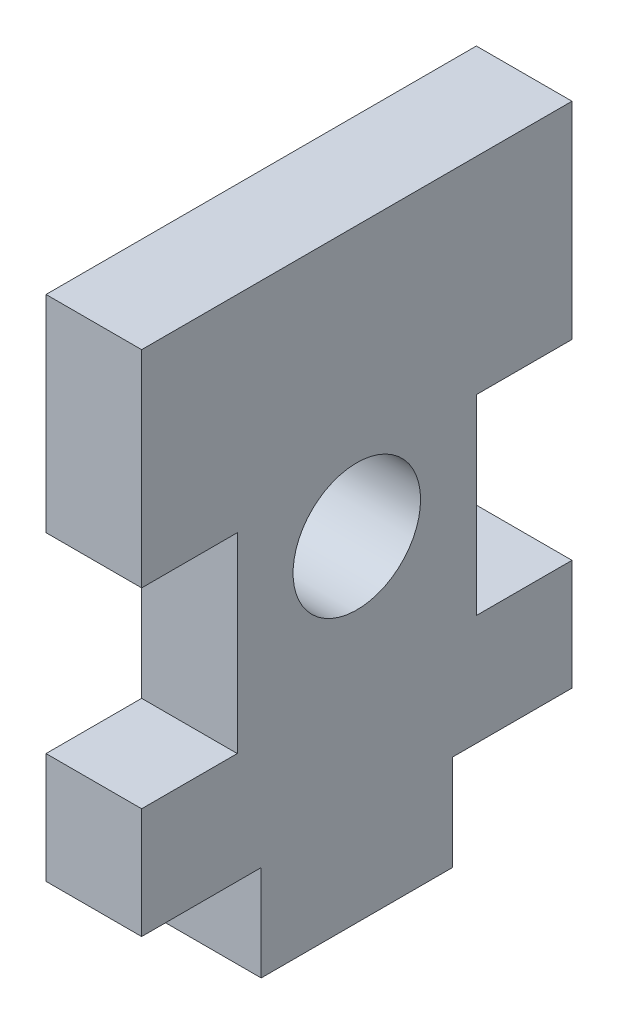
ISO-10303-21;
HEADER;
FILE_DESCRIPTION(('STEP AP214'),'2;1');
FILE_NAME('part.step','',(''),(''),'','','');
FILE_SCHEMA(('AUTOMOTIVE_DESIGN { 1 0 10303 214 1 1 1 1 }'));
ENDSEC;
DATA;
#1=APPLICATION_CONTEXT('core data for automotive mechanical design processes');
#2=APPLICATION_PROTOCOL_DEFINITION('international standard','automotive_design',2000,#1);
#3=PRODUCT_CONTEXT('',#1,'mechanical');
#4=PRODUCT('Part','Part','',(#3));
#5=PRODUCT_RELATED_PRODUCT_CATEGORY('part','',(#4));
#6=PRODUCT_DEFINITION_FORMATION('','',#4);
#7=PRODUCT_DEFINITION_CONTEXT('part definition',#1,'design');
#8=PRODUCT_DEFINITION('design','',#6,#7);
#9=PRODUCT_DEFINITION_SHAPE('','',#8);
#10=(LENGTH_UNIT() NAMED_UNIT(*) SI_UNIT(.MILLI.,.METRE.));
#11=(NAMED_UNIT(*) PLANE_ANGLE_UNIT() SI_UNIT($,.RADIAN.));
#12=(NAMED_UNIT(*) SI_UNIT($,.STERADIAN.) SOLID_ANGLE_UNIT());
#13=UNCERTAINTY_MEASURE_WITH_UNIT(LENGTH_MEASURE(1.E-05),#10,'distance_accuracy_value','');
#14=(GEOMETRIC_REPRESENTATION_CONTEXT(3) GLOBAL_UNCERTAINTY_ASSIGNED_CONTEXT((#13)) GLOBAL_UNIT_ASSIGNED_CONTEXT((#10,
#11,#12)) REPRESENTATION_CONTEXT('',''));
#15=CARTESIAN_POINT('',(0.,0.,0.));
#16=DIRECTION('',(0.,0.,1.));
#17=DIRECTION('',(1.,0.,0.));
#18=AXIS2_PLACEMENT_3D('',#15,#16,#17);
#19=CARTESIAN_POINT('',(6.,0.,0.));
#20=DIRECTION('',(1.,0.,0.));
#21=DIRECTION('',(0.,0.,-1.));
#22=AXIS2_PLACEMENT_3D('',#19,#20,#21);
#23=PLANE('',#22);
#24=DIRECTION('',(0.,0.,-1.));
#25=VECTOR('',#24,1.);
#26=CARTESIAN_POINT('',(6.,18.9458591085876,13.5));
#27=LINE('',#26,#25);
#28=CARTESIAN_POINT('',(6.,18.9458591085876,13.5));
#29=VERTEX_POINT('',#28);
#30=CARTESIAN_POINT('',(6.,18.9458591085876,7.5));
#31=VERTEX_POINT('',#30);
#32=EDGE_CURVE('E168',#29,#31,#27,.T.);
#33=ORIENTED_EDGE('',*,*,#32,.T.);
#34=DIRECTION('',(0.,1.,0.));
#35=VECTOR('',#34,1.);
#36=CARTESIAN_POINT('',(6.,6.94585910858765,7.5));
#37=LINE('',#36,#35);
#38=CARTESIAN_POINT('',(6.,6.94585910858765,7.5));
#39=VERTEX_POINT('',#38);
#40=EDGE_CURVE('E322',#39,#31,#37,.T.);
#41=ORIENTED_EDGE('',*,*,#40,.F.);
#42=DIRECTION('',(0.,0.,-1.));
#43=VECTOR('',#42,1.);
#44=CARTESIAN_POINT('',(6.,6.94585910858765,13.5));
#45=LINE('',#44,#43);
#46=CARTESIAN_POINT('',(6.,6.94585910858765,13.5));
#47=VERTEX_POINT('',#46);
#48=EDGE_CURVE('E307',#47,#39,#45,.T.);
#49=ORIENTED_EDGE('',*,*,#48,.F.);
#50=DIRECTION('',(0.,1.,0.));
#51=VECTOR('',#50,1.);
#52=CARTESIAN_POINT('',(6.,0.,13.5));
#53=LINE('',#52,#51);
#54=CARTESIAN_POINT('',(6.,0.,13.5));
#55=VERTEX_POINT('',#54);
#56=EDGE_CURVE('E320',#55,#47,#53,.T.);
#57=ORIENTED_EDGE('',*,*,#56,.F.);
#58=DIRECTION('',(0.,0.,1.));
#59=VECTOR('',#58,1.);
#60=CARTESIAN_POINT('',(6.,0.,7.5));
#61=LINE('',#60,#59);
#62=CARTESIAN_POINT('',(6.,0.,6.));
#63=VERTEX_POINT('',#62);
#64=EDGE_CURVE('E324',#63,#55,#61,.T.);
#65=ORIENTED_EDGE('',*,*,#64,.F.);
#66=DIRECTION('',(0.,-1.,0.));
#67=VECTOR('',#66,1.);
#68=CARTESIAN_POINT('',(6.,0.,6.));
#69=LINE('',#68,#67);
#70=CARTESIAN_POINT('',(6.,-6.,5.99999999999999));
#71=VERTEX_POINT('',#70);
#72=EDGE_CURVE('E330',#63,#71,#69,.T.);
#73=ORIENTED_EDGE('',*,*,#72,.T.);
#74=DIRECTION('',(0.,0.,1.));
#75=VECTOR('',#74,1.);
#76=CARTESIAN_POINT('',(6.,-5.99999999999997,-5.99999999999999));
#77=LINE('',#76,#75);
#78=CARTESIAN_POINT('',(6.,-5.99999999999997,-5.99999999999999));
#79=VERTEX_POINT('',#78);
#80=EDGE_CURVE('E332',#79,#71,#77,.T.);
#81=ORIENTED_EDGE('',*,*,#80,.F.);
#82=DIRECTION('',(0.,-1.,0.));
#83=VECTOR('',#82,1.);
#84=CARTESIAN_POINT('',(6.,0.,-6.));
#85=LINE('',#84,#83);
#86=CARTESIAN_POINT('',(6.,0.,-6.));
#87=VERTEX_POINT('',#86);
#88=EDGE_CURVE('E335',#87,#79,#85,.T.);
#89=ORIENTED_EDGE('',*,*,#88,.F.);
#90=DIRECTION('',(0.,0.,-1.));
#91=VECTOR('',#90,1.);
#92=CARTESIAN_POINT('',(6.,0.,-6.));
#93=LINE('',#92,#91);
#94=CARTESIAN_POINT('',(6.,0.,-13.5));
#95=VERTEX_POINT('',#94);
#96=EDGE_CURVE('E338',#87,#95,#93,.T.);
#97=ORIENTED_EDGE('',*,*,#96,.T.);
#98=DIRECTION('',(0.,1.,0.));
#99=VECTOR('',#98,1.);
#100=CARTESIAN_POINT('',(6.,0.,-13.5));
#101=LINE('',#100,#99);
#102=CARTESIAN_POINT('',(6.,6.94585910858766,-13.5));
#103=VERTEX_POINT('',#102);
#104=EDGE_CURVE('E340',#95,#103,#101,.T.);
#105=ORIENTED_EDGE('',*,*,#104,.T.);
#106=DIRECTION('',(0.,0.,1.));
#107=VECTOR('',#106,1.);
#108=CARTESIAN_POINT('',(6.,6.94585910858766,-13.5));
#109=LINE('',#108,#107);
#110=CARTESIAN_POINT('',(6.,6.94585910858766,-7.5));
#111=VERTEX_POINT('',#110);
#112=EDGE_CURVE('E342',#103,#111,#109,.T.);
#113=ORIENTED_EDGE('',*,*,#112,.T.);
#114=DIRECTION('',(0.,1.,0.));
#115=VECTOR('',#114,1.);
#116=CARTESIAN_POINT('',(6.,6.94585910858766,-7.5));
#117=LINE('',#116,#115);
#118=CARTESIAN_POINT('',(6.,18.9458591085876,-7.5));
#119=VERTEX_POINT('',#118);
#120=EDGE_CURVE('E344',#111,#119,#117,.T.);
#121=ORIENTED_EDGE('',*,*,#120,.T.);
#122=DIRECTION('',(0.,0.,1.));
#123=VECTOR('',#122,1.);
#124=CARTESIAN_POINT('',(6.,18.9458591085876,-13.5));
#125=LINE('',#124,#123);
#126=CARTESIAN_POINT('',(6.,18.9458591085876,-13.5));
#127=VERTEX_POINT('',#126);
#128=EDGE_CURVE('E214',#127,#119,#125,.T.);
#129=ORIENTED_EDGE('',*,*,#128,.F.);
#130=DIRECTION('',(0.,1.,0.));
#131=VECTOR('',#130,1.);
#132=CARTESIAN_POINT('',(6.,18.9458591085876,-13.5));
#133=LINE('',#132,#131);
#134=CARTESIAN_POINT('',(6.,31.8917182171753,-13.5));
#135=VERTEX_POINT('',#134);
#136=EDGE_CURVE('E208',#127,#135,#133,.T.);
#137=ORIENTED_EDGE('',*,*,#136,.T.);
#138=DIRECTION('',(0.,0.,1.));
#139=VECTOR('',#138,1.);
#140=CARTESIAN_POINT('',(6.,31.8917182171753,-13.5));
#141=LINE('',#140,#139);
#142=CARTESIAN_POINT('',(6.,31.8917182171753,13.5));
#143=VERTEX_POINT('',#142);
#144=EDGE_CURVE('E212',#135,#143,#141,.T.);
#145=ORIENTED_EDGE('',*,*,#144,.T.);
#146=DIRECTION('',(0.,1.,0.));
#147=VECTOR('',#146,1.);
#148=CARTESIAN_POINT('',(6.,18.9458591085876,13.5));
#149=LINE('',#148,#147);
#150=EDGE_CURVE('E227',#29,#143,#149,.T.);
#151=ORIENTED_EDGE('',*,*,#150,.F.);
#152=EDGE_LOOP('',(#33,#41,#49,#57,#65,#73,#81,#89,#97,#105,#113,#121,#129,#137,#145,#151));
#153=FACE_BOUND('',#152,.T.);
#154=CARTESIAN_POINT('',(6.,15.,0.));
#155=DIRECTION('',(1.,0.,0.));
#156=DIRECTION('',(0.,0.,-1.));
#157=AXIS2_PLACEMENT_3D('',#154,#155,#156);
#158=CIRCLE('',#157,4.);
#159=CARTESIAN_POINT('',(6.,15.,-4.));
#160=VERTEX_POINT('',#159);
#161=EDGE_CURVE('E235',#160,#160,#158,.T.);
#162=ORIENTED_EDGE('',*,*,#161,.F.);
#163=EDGE_LOOP('',(#162));
#164=FACE_BOUND('',#163,.T.);
#165=ADVANCED_FACE('F89',(#153,#164),#23,.T.);
#166=CARTESIAN_POINT('',(0.,0.,0.));
#167=DIRECTION('',(1.,0.,0.));
#168=DIRECTION('',(0.,0.,-1.));
#169=AXIS2_PLACEMENT_3D('',#166,#167,#168);
#170=PLANE('',#169);
#171=DIRECTION('',(0.,0.,-1.));
#172=VECTOR('',#171,1.);
#173=CARTESIAN_POINT('',(0.,18.9458591085876,13.5));
#174=LINE('',#173,#172);
#175=CARTESIAN_POINT('',(0.,18.9458591085876,13.5));
#176=VERTEX_POINT('',#175);
#177=CARTESIAN_POINT('',(0.,18.9458591085876,7.5));
#178=VERTEX_POINT('',#177);
#179=EDGE_CURVE('E232',#176,#178,#174,.T.);
#180=ORIENTED_EDGE('',*,*,#179,.F.);
#181=DIRECTION('',(0.,1.,0.));
#182=VECTOR('',#181,1.);
#183=CARTESIAN_POINT('',(0.,18.9458591085876,13.5));
#184=LINE('',#183,#182);
#185=CARTESIAN_POINT('',(0.,31.8917182171753,13.5));
#186=VERTEX_POINT('',#185);
#187=EDGE_CURVE('E270',#176,#186,#184,.T.);
#188=ORIENTED_EDGE('',*,*,#187,.T.);
#189=DIRECTION('',(0.,0.,1.));
#190=VECTOR('',#189,1.);
#191=CARTESIAN_POINT('',(0.,31.8917182171753,-13.5));
#192=LINE('',#191,#190);
#193=CARTESIAN_POINT('',(0.,31.8917182171753,-13.5));
#194=VERTEX_POINT('',#193);
#195=EDGE_CURVE('E268',#194,#186,#192,.T.);
#196=ORIENTED_EDGE('',*,*,#195,.F.);
#197=DIRECTION('',(0.,1.,0.));
#198=VECTOR('',#197,1.);
#199=CARTESIAN_POINT('',(0.,18.9458591085876,-13.5));
#200=LINE('',#199,#198);
#201=CARTESIAN_POINT('',(0.,18.9458591085876,-13.5));
#202=VERTEX_POINT('',#201);
#203=EDGE_CURVE('E221',#202,#194,#200,.T.);
#204=ORIENTED_EDGE('',*,*,#203,.F.);
#205=DIRECTION('',(0.,0.,1.));
#206=VECTOR('',#205,1.);
#207=CARTESIAN_POINT('',(0.,18.9458591085876,-13.5));
#208=LINE('',#207,#206);
#209=CARTESIAN_POINT('',(0.,18.9458591085876,-7.5));
#210=VERTEX_POINT('',#209);
#211=EDGE_CURVE('E264',#202,#210,#208,.T.);
#212=ORIENTED_EDGE('',*,*,#211,.T.);
#213=DIRECTION('',(0.,1.,0.));
#214=VECTOR('',#213,1.);
#215=CARTESIAN_POINT('',(0.,6.94585910858766,-7.5));
#216=LINE('',#215,#214);
#217=CARTESIAN_POINT('',(0.,6.94585910858766,-7.5));
#218=VERTEX_POINT('',#217);
#219=EDGE_CURVE('E261',#218,#210,#216,.T.);
#220=ORIENTED_EDGE('',*,*,#219,.F.);
#221=DIRECTION('',(0.,0.,1.));
#222=VECTOR('',#221,1.);
#223=CARTESIAN_POINT('',(0.,6.94585910858766,-13.5));
#224=LINE('',#223,#222);
#225=CARTESIAN_POINT('',(0.,6.94585910858766,-13.5));
#226=VERTEX_POINT('',#225);
#227=EDGE_CURVE('E259',#226,#218,#224,.T.);
#228=ORIENTED_EDGE('',*,*,#227,.F.);
#229=DIRECTION('',(0.,1.,0.));
#230=VECTOR('',#229,1.);
#231=CARTESIAN_POINT('',(0.,0.,-13.5));
#232=LINE('',#231,#230);
#233=CARTESIAN_POINT('',(0.,0.,-13.5));
#234=VERTEX_POINT('',#233);
#235=EDGE_CURVE('E257',#234,#226,#232,.T.);
#236=ORIENTED_EDGE('',*,*,#235,.F.);
#237=DIRECTION('',(0.,0.,-1.));
#238=VECTOR('',#237,1.);
#239=CARTESIAN_POINT('',(0.,0.,-7.5));
#240=LINE('',#239,#238);
#241=CARTESIAN_POINT('',(0.,0.,-6.));
#242=VERTEX_POINT('',#241);
#243=EDGE_CURVE('E255',#242,#234,#240,.T.);
#244=ORIENTED_EDGE('',*,*,#243,.F.);
#245=DIRECTION('',(0.,-1.,0.));
#246=VECTOR('',#245,1.);
#247=CARTESIAN_POINT('',(0.,0.,-6.));
#248=LINE('',#247,#246);
#249=CARTESIAN_POINT('',(0.,-5.99999999999997,-5.99999999999999));
#250=VERTEX_POINT('',#249);
#251=EDGE_CURVE('E252',#242,#250,#248,.T.);
#252=ORIENTED_EDGE('',*,*,#251,.T.);
#253=DIRECTION('',(0.,0.,1.));
#254=VECTOR('',#253,1.);
#255=CARTESIAN_POINT('',(0.,-5.99999999999997,-5.99999999999999));
#256=LINE('',#255,#254);
#257=CARTESIAN_POINT('',(0.,-6.,5.99999999999999));
#258=VERTEX_POINT('',#257);
#259=EDGE_CURVE('E249',#250,#258,#256,.T.);
#260=ORIENTED_EDGE('',*,*,#259,.T.);
#261=DIRECTION('',(0.,-1.,0.));
#262=VECTOR('',#261,1.);
#263=CARTESIAN_POINT('',(0.,0.,6.));
#264=LINE('',#263,#262);
#265=CARTESIAN_POINT('',(0.,0.,6.));
#266=VERTEX_POINT('',#265);
#267=EDGE_CURVE('E246',#266,#258,#264,.T.);
#268=ORIENTED_EDGE('',*,*,#267,.F.);
#269=DIRECTION('',(0.,0.,-1.));
#270=VECTOR('',#269,1.);
#271=CARTESIAN_POINT('',(0.,0.,7.5));
#272=LINE('',#271,#270);
#273=CARTESIAN_POINT('',(0.,0.,13.5));
#274=VERTEX_POINT('',#273);
#275=EDGE_CURVE('E244',#274,#266,#272,.T.);
#276=ORIENTED_EDGE('',*,*,#275,.F.);
#277=DIRECTION('',(0.,1.,0.));
#278=VECTOR('',#277,1.);
#279=CARTESIAN_POINT('',(0.,0.,13.5));
#280=LINE('',#279,#278);
#281=CARTESIAN_POINT('',(0.,6.94585910858765,13.5));
#282=VERTEX_POINT('',#281);
#283=EDGE_CURVE('E241',#274,#282,#280,.T.);
#284=ORIENTED_EDGE('',*,*,#283,.T.);
#285=DIRECTION('',(0.,0.,-1.));
#286=VECTOR('',#285,1.);
#287=CARTESIAN_POINT('',(0.,6.94585910858765,13.5));
#288=LINE('',#287,#286);
#289=CARTESIAN_POINT('',(0.,6.94585910858765,7.5));
#290=VERTEX_POINT('',#289);
#291=EDGE_CURVE('E238',#282,#290,#288,.T.);
#292=ORIENTED_EDGE('',*,*,#291,.T.);
#293=DIRECTION('',(0.,1.,0.));
#294=VECTOR('',#293,1.);
#295=CARTESIAN_POINT('',(0.,6.94585910858765,7.5));
#296=LINE('',#295,#294);
#297=EDGE_CURVE('E234',#290,#178,#296,.T.);
#298=ORIENTED_EDGE('',*,*,#297,.T.);
#299=EDGE_LOOP('',(#180,#188,#196,#204,#212,#220,#228,#236,#244,#252,#260,#268,#276,#284,#292,#298));
#300=FACE_BOUND('',#299,.T.);
#301=CARTESIAN_POINT('',(0.,15.,0.));
#302=DIRECTION('',(1.,0.,0.));
#303=DIRECTION('',(0.,0.,-1.));
#304=AXIS2_PLACEMENT_3D('',#301,#302,#303);
#305=CIRCLE('',#304,4.);
#306=CARTESIAN_POINT('',(0.,15.,-4.));
#307=VERTEX_POINT('',#306);
#308=EDGE_CURVE('E374',#307,#307,#305,.T.);
#309=ORIENTED_EDGE('',*,*,#308,.T.);
#310=EDGE_LOOP('',(#309));
#311=FACE_BOUND('',#310,.T.);
#312=ADVANCED_FACE('F312',(#300,#311),#170,.F.);
#313=CARTESIAN_POINT('',(6.,18.9458591085876,13.5));
#314=DIRECTION('',(0.,1.,0.));
#315=DIRECTION('',(0.,0.,1.));
#316=AXIS2_PLACEMENT_3D('',#313,#314,#315);
#317=PLANE('',#316);
#318=ORIENTED_EDGE('',*,*,#179,.T.);
#319=DIRECTION('',(-1.,0.,0.));
#320=VECTOR('',#319,1.);
#321=CARTESIAN_POINT('',(6.,18.9458591085876,7.5));
#322=LINE('',#321,#320);
#323=EDGE_CURVE('E12',#31,#178,#322,.T.);
#324=ORIENTED_EDGE('',*,*,#323,.F.);
#325=ORIENTED_EDGE('',*,*,#32,.F.);
#326=DIRECTION('',(-1.,0.,0.));
#327=VECTOR('',#326,1.);
#328=CARTESIAN_POINT('',(6.,18.9458591085876,13.5));
#329=LINE('',#328,#327);
#330=EDGE_CURVE('E106',#29,#176,#329,.T.);
#331=ORIENTED_EDGE('',*,*,#330,.T.);
#332=EDGE_LOOP('',(#318,#324,#325,#331));
#333=FACE_BOUND('',#332,.T.);
#334=ADVANCED_FACE('F91',(#333),#317,.F.);
#335=CARTESIAN_POINT('',(6.,6.94585910858765,7.5));
#336=DIRECTION('',(0.,0.,1.));
#337=DIRECTION('',(1.,0.,0.));
#338=AXIS2_PLACEMENT_3D('',#335,#336,#337);
#339=PLANE('',#338);
#340=ORIENTED_EDGE('',*,*,#297,.F.);
#341=DIRECTION('',(-1.,0.,0.));
#342=VECTOR('',#341,1.);
#343=CARTESIAN_POINT('',(6.,6.94585910858765,7.5));
#344=LINE('',#343,#342);
#345=EDGE_CURVE('E98',#39,#290,#344,.T.);
#346=ORIENTED_EDGE('',*,*,#345,.F.);
#347=ORIENTED_EDGE('',*,*,#40,.T.);
#348=ORIENTED_EDGE('',*,*,#323,.T.);
#349=EDGE_LOOP('',(#340,#346,#347,#348));
#350=FACE_BOUND('',#349,.T.);
#351=ADVANCED_FACE('F310',(#350),#339,.T.);
#352=CARTESIAN_POINT('',(6.,6.94585910858765,13.5));
#353=DIRECTION('',(0.,1.,0.));
#354=DIRECTION('',(0.,0.,1.));
#355=AXIS2_PLACEMENT_3D('',#352,#353,#354);
#356=PLANE('',#355);
#357=ORIENTED_EDGE('',*,*,#291,.F.);
#358=DIRECTION('',(-1.,0.,0.));
#359=VECTOR('',#358,1.);
#360=CARTESIAN_POINT('',(6.,6.94585910858765,13.5));
#361=LINE('',#360,#359);
#362=EDGE_CURVE('E300',#47,#282,#361,.T.);
#363=ORIENTED_EDGE('',*,*,#362,.F.);
#364=ORIENTED_EDGE('',*,*,#48,.T.);
#365=ORIENTED_EDGE('',*,*,#345,.T.);
#366=EDGE_LOOP('',(#357,#363,#364,#365));
#367=FACE_BOUND('',#366,.T.);
#368=ADVANCED_FACE('F305',(#367),#356,.T.);
#369=CARTESIAN_POINT('',(6.,0.,13.5));
#370=DIRECTION('',(0.,0.,1.));
#371=DIRECTION('',(0.,-1.,0.));
#372=AXIS2_PLACEMENT_3D('',#369,#370,#371);
#373=PLANE('',#372);
#374=ORIENTED_EDGE('',*,*,#283,.F.);
#375=DIRECTION('',(-1.,0.,0.));
#376=VECTOR('',#375,1.);
#377=CARTESIAN_POINT('',(6.,0.,13.5));
#378=LINE('',#377,#376);
#379=EDGE_CURVE('E297',#55,#274,#378,.T.);
#380=ORIENTED_EDGE('',*,*,#379,.F.);
#381=ORIENTED_EDGE('',*,*,#56,.T.);
#382=ORIENTED_EDGE('',*,*,#362,.T.);
#383=EDGE_LOOP('',(#374,#380,#381,#382));
#384=FACE_BOUND('',#383,.T.);
#385=ADVANCED_FACE('F317',(#384),#373,.T.);
#386=CARTESIAN_POINT('',(6.,0.,7.5));
#387=DIRECTION('',(0.,1.,0.));
#388=DIRECTION('',(0.,0.,1.));
#389=AXIS2_PLACEMENT_3D('',#386,#387,#388);
#390=PLANE('',#389);
#391=ORIENTED_EDGE('',*,*,#275,.T.);
#392=DIRECTION('',(-1.,0.,0.));
#393=VECTOR('',#392,1.);
#394=CARTESIAN_POINT('',(6.,0.,6.));
#395=LINE('',#394,#393);
#396=EDGE_CURVE('E294',#63,#266,#395,.T.);
#397=ORIENTED_EDGE('',*,*,#396,.F.);
#398=ORIENTED_EDGE('',*,*,#64,.T.);
#399=ORIENTED_EDGE('',*,*,#379,.T.);
#400=EDGE_LOOP('',(#391,#397,#398,#399));
#401=FACE_BOUND('',#400,.T.);
#402=ADVANCED_FACE('F388',(#401),#390,.F.);
#403=CARTESIAN_POINT('',(6.,0.,6.));
#404=DIRECTION('',(0.,0.,-1.));
#405=DIRECTION('',(0.,1.,0.));
#406=AXIS2_PLACEMENT_3D('',#403,#404,#405);
#407=PLANE('',#406);
#408=ORIENTED_EDGE('',*,*,#267,.T.);
#409=DIRECTION('',(-1.,0.,0.));
#410=VECTOR('',#409,1.);
#411=CARTESIAN_POINT('',(6.,-6.,5.99999999999999));
#412=LINE('',#411,#410);
#413=EDGE_CURVE('E292',#71,#258,#412,.T.);
#414=ORIENTED_EDGE('',*,*,#413,.F.);
#415=ORIENTED_EDGE('',*,*,#72,.F.);
#416=ORIENTED_EDGE('',*,*,#396,.T.);
#417=EDGE_LOOP('',(#408,#414,#415,#416));
#418=FACE_BOUND('',#417,.T.);
#419=ADVANCED_FACE('F391',(#418),#407,.F.);
#420=CARTESIAN_POINT('',(6.,-5.99999999999997,-5.99999999999999));
#421=DIRECTION('',(0.,-1.,0.));
#422=DIRECTION('',(0.,0.,-1.));
#423=AXIS2_PLACEMENT_3D('',#420,#421,#422);
#424=PLANE('',#423);
#425=ORIENTED_EDGE('',*,*,#259,.F.);
#426=DIRECTION('',(-1.,0.,0.));
#427=VECTOR('',#426,1.);
#428=CARTESIAN_POINT('',(6.,-5.99999999999997,-5.99999999999999));
#429=LINE('',#428,#427);
#430=EDGE_CURVE('E290',#79,#250,#429,.T.);
#431=ORIENTED_EDGE('',*,*,#430,.F.);
#432=ORIENTED_EDGE('',*,*,#80,.T.);
#433=ORIENTED_EDGE('',*,*,#413,.T.);
#434=EDGE_LOOP('',(#425,#431,#432,#433));
#435=FACE_BOUND('',#434,.T.);
#436=ADVANCED_FACE('F395',(#435),#424,.T.);
#437=CARTESIAN_POINT('',(6.,0.,-6.));
#438=DIRECTION('',(0.,0.,-1.));
#439=DIRECTION('',(0.,1.,0.));
#440=AXIS2_PLACEMENT_3D('',#437,#438,#439);
#441=PLANE('',#440);
#442=ORIENTED_EDGE('',*,*,#251,.F.);
#443=DIRECTION('',(-1.,0.,0.));
#444=VECTOR('',#443,1.);
#445=CARTESIAN_POINT('',(6.,0.,-6.));
#446=LINE('',#445,#444);
#447=EDGE_CURVE('E287',#87,#242,#446,.T.);
#448=ORIENTED_EDGE('',*,*,#447,.F.);
#449=ORIENTED_EDGE('',*,*,#88,.T.);
#450=ORIENTED_EDGE('',*,*,#430,.T.);
#451=EDGE_LOOP('',(#442,#448,#449,#450));
#452=FACE_BOUND('',#451,.T.);
#453=ADVANCED_FACE('F399',(#452),#441,.T.);
#454=CARTESIAN_POINT('',(6.,0.,-7.5));
#455=DIRECTION('',(0.,1.,0.));
#456=DIRECTION('',(0.,0.,1.));
#457=AXIS2_PLACEMENT_3D('',#454,#455,#456);
#458=PLANE('',#457);
#459=ORIENTED_EDGE('',*,*,#243,.T.);
#460=DIRECTION('',(-1.,0.,0.));
#461=VECTOR('',#460,1.);
#462=CARTESIAN_POINT('',(6.,0.,-13.5));
#463=LINE('',#462,#461);
#464=EDGE_CURVE('E284',#95,#234,#463,.T.);
#465=ORIENTED_EDGE('',*,*,#464,.F.);
#466=ORIENTED_EDGE('',*,*,#96,.F.);
#467=ORIENTED_EDGE('',*,*,#447,.T.);
#468=EDGE_LOOP('',(#459,#465,#466,#467));
#469=FACE_BOUND('',#468,.T.);
#470=ADVANCED_FACE('F403',(#469),#458,.F.);
#471=CARTESIAN_POINT('',(6.,0.,-13.5));
#472=DIRECTION('',(0.,0.,1.));
#473=DIRECTION('',(0.,-1.,0.));
#474=AXIS2_PLACEMENT_3D('',#471,#472,#473);
#475=PLANE('',#474);
#476=ORIENTED_EDGE('',*,*,#235,.T.);
#477=DIRECTION('',(-1.,0.,0.));
#478=VECTOR('',#477,1.);
#479=CARTESIAN_POINT('',(6.,6.94585910858766,-13.5));
#480=LINE('',#479,#478);
#481=EDGE_CURVE('E281',#103,#226,#480,.T.);
#482=ORIENTED_EDGE('',*,*,#481,.F.);
#483=ORIENTED_EDGE('',*,*,#104,.F.);
#484=ORIENTED_EDGE('',*,*,#464,.T.);
#485=EDGE_LOOP('',(#476,#482,#483,#484));
#486=FACE_BOUND('',#485,.T.);
#487=ADVANCED_FACE('F407',(#486),#475,.F.);
#488=CARTESIAN_POINT('',(6.,6.94585910858766,-13.5));
#489=DIRECTION('',(0.,-1.,0.));
#490=DIRECTION('',(0.,0.,-1.));
#491=AXIS2_PLACEMENT_3D('',#488,#489,#490);
#492=PLANE('',#491);
#493=ORIENTED_EDGE('',*,*,#227,.T.);
#494=DIRECTION('',(-1.,0.,0.));
#495=VECTOR('',#494,1.);
#496=CARTESIAN_POINT('',(6.,6.94585910858766,-7.5));
#497=LINE('',#496,#495);
#498=EDGE_CURVE('E278',#111,#218,#497,.T.);
#499=ORIENTED_EDGE('',*,*,#498,.F.);
#500=ORIENTED_EDGE('',*,*,#112,.F.);
#501=ORIENTED_EDGE('',*,*,#481,.T.);
#502=EDGE_LOOP('',(#493,#499,#500,#501));
#503=FACE_BOUND('',#502,.T.);
#504=ADVANCED_FACE('F411',(#503),#492,.F.);
#505=CARTESIAN_POINT('',(6.,6.94585910858766,-7.5));
#506=DIRECTION('',(0.,0.,1.));
#507=DIRECTION('',(1.,0.,0.));
#508=AXIS2_PLACEMENT_3D('',#505,#506,#507);
#509=PLANE('',#508);
#510=ORIENTED_EDGE('',*,*,#219,.T.);
#511=DIRECTION('',(-1.,0.,0.));
#512=VECTOR('',#511,1.);
#513=CARTESIAN_POINT('',(6.,18.9458591085876,-7.5));
#514=LINE('',#513,#512);
#515=EDGE_CURVE('E276',#119,#210,#514,.T.);
#516=ORIENTED_EDGE('',*,*,#515,.F.);
#517=ORIENTED_EDGE('',*,*,#120,.F.);
#518=ORIENTED_EDGE('',*,*,#498,.T.);
#519=EDGE_LOOP('',(#510,#516,#517,#518));
#520=FACE_BOUND('',#519,.T.);
#521=ADVANCED_FACE('F415',(#520),#509,.F.);
#522=CARTESIAN_POINT('',(6.,18.9458591085876,-13.5));
#523=DIRECTION('',(0.,-1.,0.));
#524=DIRECTION('',(0.,0.,-1.));
#525=AXIS2_PLACEMENT_3D('',#522,#523,#524);
#526=PLANE('',#525);
#527=ORIENTED_EDGE('',*,*,#211,.F.);
#528=DIRECTION('',(-1.,0.,0.));
#529=VECTOR('',#528,1.);
#530=CARTESIAN_POINT('',(6.,18.9458591085876,-13.5));
#531=LINE('',#530,#529);
#532=EDGE_CURVE('E224',#127,#202,#531,.T.);
#533=ORIENTED_EDGE('',*,*,#532,.F.);
#534=ORIENTED_EDGE('',*,*,#128,.T.);
#535=ORIENTED_EDGE('',*,*,#515,.T.);
#536=EDGE_LOOP('',(#527,#533,#534,#535));
#537=FACE_BOUND('',#536,.T.);
#538=ADVANCED_FACE('F347',(#537),#526,.T.);
#539=CARTESIAN_POINT('',(6.,18.9458591085876,-13.5));
#540=DIRECTION('',(0.,0.,1.));
#541=DIRECTION('',(0.,-1.,0.));
#542=AXIS2_PLACEMENT_3D('',#539,#540,#541);
#543=PLANE('',#542);
#544=ORIENTED_EDGE('',*,*,#203,.T.);
#545=DIRECTION('',(-1.,0.,0.));
#546=VECTOR('',#545,1.);
#547=CARTESIAN_POINT('',(6.,31.8917182171753,-13.5));
#548=LINE('',#547,#546);
#549=EDGE_CURVE('E218',#135,#194,#548,.T.);
#550=ORIENTED_EDGE('',*,*,#549,.F.);
#551=ORIENTED_EDGE('',*,*,#136,.F.);
#552=ORIENTED_EDGE('',*,*,#532,.T.);
#553=EDGE_LOOP('',(#544,#550,#551,#552));
#554=FACE_BOUND('',#553,.T.);
#555=ADVANCED_FACE('F219',(#554),#543,.F.);
#556=CARTESIAN_POINT('',(6.,31.8917182171753,-13.5));
#557=DIRECTION('',(0.,-1.,0.));
#558=DIRECTION('',(0.,0.,-1.));
#559=AXIS2_PLACEMENT_3D('',#556,#557,#558);
#560=PLANE('',#559);
#561=ORIENTED_EDGE('',*,*,#195,.T.);
#562=DIRECTION('',(-1.,0.,0.));
#563=VECTOR('',#562,1.);
#564=CARTESIAN_POINT('',(6.,31.8917182171753,13.5));
#565=LINE('',#564,#563);
#566=EDGE_CURVE('E156',#143,#186,#565,.T.);
#567=ORIENTED_EDGE('',*,*,#566,.F.);
#568=ORIENTED_EDGE('',*,*,#144,.F.);
#569=ORIENTED_EDGE('',*,*,#549,.T.);
#570=EDGE_LOOP('',(#561,#567,#568,#569));
#571=FACE_BOUND('',#570,.T.);
#572=ADVANCED_FACE('F226',(#571),#560,.F.);
#573=CARTESIAN_POINT('',(6.,18.9458591085876,13.5));
#574=DIRECTION('',(0.,0.,1.));
#575=DIRECTION('',(1.,0.,0.));
#576=AXIS2_PLACEMENT_3D('',#573,#574,#575);
#577=PLANE('',#576);
#578=ORIENTED_EDGE('',*,*,#187,.F.);
#579=ORIENTED_EDGE('',*,*,#330,.F.);
#580=ORIENTED_EDGE('',*,*,#150,.T.);
#581=ORIENTED_EDGE('',*,*,#566,.T.);
#582=EDGE_LOOP('',(#578,#579,#580,#581));
#583=FACE_BOUND('',#582,.T.);
#584=ADVANCED_FACE('F350',(#583),#577,.T.);
#585=CARTESIAN_POINT('',(6.,15.,0.));
#586=DIRECTION('',(-1.,0.,0.));
#587=DIRECTION('',(0.,0.,1.));
#588=AXIS2_PLACEMENT_3D('',#585,#586,#587);
#589=CYLINDRICAL_SURFACE('',#588,4.);
#590=ORIENTED_EDGE('',*,*,#161,.T.);
#591=EDGE_LOOP('',(#590));
#592=FACE_BOUND('',#591,.T.);
#593=ORIENTED_EDGE('',*,*,#308,.F.);
#594=EDGE_LOOP('',(#593));
#595=FACE_BOUND('',#594,.T.);
#596=ADVANCED_FACE('F352',(#592,#595),#589,.F.);
#597=CLOSED_SHELL('',(#165,#312,#334,#351,#368,#385,#402,#419,#436,#453,#470,#487,#504,#521,
#538,#555,#572,#584,#596));
#598=MANIFOLD_SOLID_BREP('B2',#597);
#599=ADVANCED_BREP_SHAPE_REPRESENTATION('',(#18,#598),#14);
#600=SHAPE_DEFINITION_REPRESENTATION(#9,#599);
ENDSEC;
END-ISO-10303-21;
